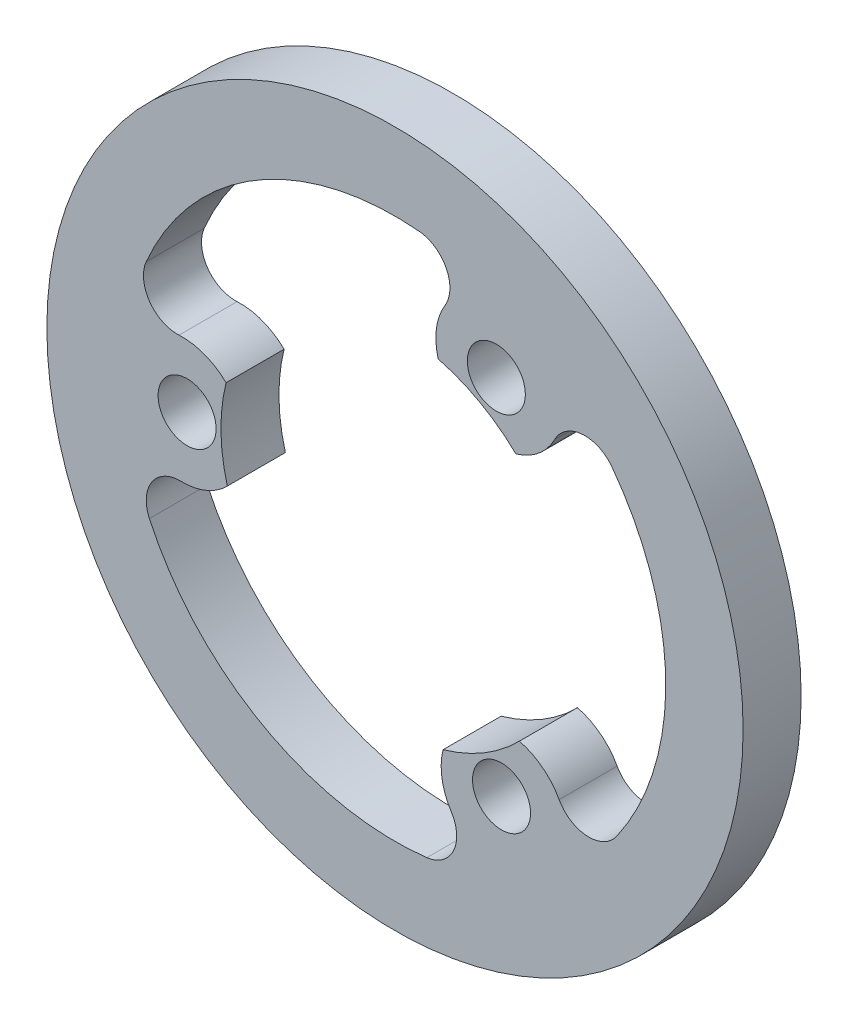
ISO-10303-21;
HEADER;
FILE_DESCRIPTION(('STEP AP214'),'2;1');
FILE_NAME('part.step','',(''),(''),'','','');
FILE_SCHEMA(('AUTOMOTIVE_DESIGN { 1 0 10303 214 1 1 1 1 }'));
ENDSEC;
DATA;
#1=APPLICATION_CONTEXT('core data for automotive mechanical design processes');
#2=APPLICATION_PROTOCOL_DEFINITION('international standard','automotive_design',2000,#1);
#3=PRODUCT_CONTEXT('',#1,'mechanical');
#4=PRODUCT('Part','Part','',(#3));
#5=PRODUCT_RELATED_PRODUCT_CATEGORY('part','',(#4));
#6=PRODUCT_DEFINITION_FORMATION('','',#4);
#7=PRODUCT_DEFINITION_CONTEXT('part definition',#1,'design');
#8=PRODUCT_DEFINITION('design','',#6,#7);
#9=PRODUCT_DEFINITION_SHAPE('','',#8);
#10=(LENGTH_UNIT() NAMED_UNIT(*) SI_UNIT(.MILLI.,.METRE.));
#11=(NAMED_UNIT(*) PLANE_ANGLE_UNIT() SI_UNIT($,.RADIAN.));
#12=(NAMED_UNIT(*) SI_UNIT($,.STERADIAN.) SOLID_ANGLE_UNIT());
#13=UNCERTAINTY_MEASURE_WITH_UNIT(LENGTH_MEASURE(1.E-05),#10,'distance_accuracy_value','');
#14=(GEOMETRIC_REPRESENTATION_CONTEXT(3) GLOBAL_UNCERTAINTY_ASSIGNED_CONTEXT((#13)) GLOBAL_UNIT_ASSIGNED_CONTEXT((#10,
#11,#12)) REPRESENTATION_CONTEXT('',''));
#15=CARTESIAN_POINT('',(0.,0.,0.));
#16=DIRECTION('',(0.,0.,1.));
#17=DIRECTION('',(1.,0.,0.));
#18=AXIS2_PLACEMENT_3D('',#15,#16,#17);
#19=CARTESIAN_POINT('',(0.,0.,3.));
#20=DIRECTION('',(0.,0.,1.));
#21=DIRECTION('',(1.,0.,0.));
#22=AXIS2_PLACEMENT_3D('',#19,#20,#21);
#23=PLANE('',#22);
#24=CARTESIAN_POINT('',(5.24045327565877,9.38616798622511,3.));
#25=DIRECTION('',(0.,0.,1.));
#26=DIRECTION('',(1.,0.,0.));
#27=AXIS2_PLACEMENT_3D('',#24,#25,#26);
#28=CIRCLE('',#27,1.49999999999964);
#29=CARTESIAN_POINT('',(6.74045327565841,9.38616798622511,3.));
#30=VERTEX_POINT('',#29);
#31=EDGE_CURVE('E558',#30,#30,#28,.T.);
#32=ORIENTED_EDGE('',*,*,#31,.F.);
#33=EDGE_LOOP('',(#32));
#34=FACE_BOUND('',#33,.T.);
#35=CARTESIAN_POINT('',(5.36232428206866,9.60445096264907,3.));
#36=DIRECTION('',(0.,0.,-1.));
#37=DIRECTION('',(1.,0.,0.));
#38=AXIS2_PLACEMENT_3D('',#35,#36,#37);
#39=CIRCLE('',#38,3.24999999999995);
#40=CARTESIAN_POINT('',(2.23557337278891,8.71792473555933,3.));
#41=VERTEX_POINT('',#40);
#42=CARTESIAN_POINT('',(2.58509341993289,11.2924938348535,3.));
#43=VERTEX_POINT('',#42);
#44=EDGE_CURVE('E165',#41,#43,#39,.T.);
#45=ORIENTED_EDGE('',*,*,#44,.F.);
#46=CARTESIAN_POINT('',(0.,0.,3.));
#47=DIRECTION('',(0.,0.,1.));
#48=DIRECTION('',(1.,0.,0.));
#49=AXIS2_PLACEMENT_3D('',#46,#47,#48);
#50=CIRCLE('',#49,9.);
#51=CARTESIAN_POINT('',(6.24831055075268,6.47754700958259,3.));
#52=VERTEX_POINT('',#51);
#53=EDGE_CURVE('E157',#52,#41,#50,.T.);
#54=ORIENTED_EDGE('',*,*,#53,.F.);
#55=CARTESIAN_POINT('',(5.36232428206866,9.60445096264907,3.));
#56=DIRECTION('',(0.,0.,-1.));
#57=DIRECTION('',(1.,0.,0.));
#58=AXIS2_PLACEMENT_3D('',#55,#56,#57);
#59=CIRCLE('',#58,3.24999999999991);
#60=CARTESIAN_POINT('',(8.25657900831403,8.12600935757779,3.));
#61=VERTEX_POINT('',#60);
#62=EDGE_CURVE('E211',#61,#52,#59,.T.);
#63=ORIENTED_EDGE('',*,*,#62,.F.);
#64=CARTESIAN_POINT('',(9.81502386090853,7.32992541638698,3.));
#65=DIRECTION('',(0.,0.,1.));
#66=DIRECTION('',(1.,0.,0.));
#67=AXIS2_PLACEMENT_3D('',#64,#65,#66);
#68=CIRCLE('',#67,1.75000000000001);
#69=CARTESIAN_POINT('',(11.2171701267533,8.37705761872707,3.));
#70=VERTEX_POINT('',#69);
#71=EDGE_CURVE('E209',#70,#61,#68,.T.);
#72=ORIENTED_EDGE('',*,*,#71,.F.);
#73=CARTESIAN_POINT('',(0.,0.,3.));
#74=DIRECTION('',(0.,0.,1.));
#75=DIRECTION('',(1.,0.,0.));
#76=AXIS2_PLACEMENT_3D('',#73,#74,#75);
#77=CIRCLE('',#76,14.);
#78=CARTESIAN_POINT('',(11.4536300472761,-8.05073653401565,3.));
#79=VERTEX_POINT('',#78);
#80=EDGE_CURVE('E207',#79,#70,#77,.T.);
#81=ORIENTED_EDGE('',*,*,#80,.F.);
#82=CARTESIAN_POINT('',(10.021926291367,-7.0443944672636,3.));
#83=DIRECTION('',(0.,0.,1.));
#84=DIRECTION('',(1.,0.,0.));
#85=AXIS2_PLACEMENT_3D('',#82,#83,#84);
#86=CIRCLE('',#85,1.74999999999971);
#87=CARTESIAN_POINT('',(8.48703982309588,-7.88500349024465,3.));
#88=VERTEX_POINT('',#87);
#89=EDGE_CURVE('E205',#88,#79,#86,.T.);
#90=ORIENTED_EDGE('',*,*,#89,.F.);
#91=CARTESIAN_POINT('',(5.63653638202168,-9.44613453292614,3.));
#92=DIRECTION('',(0.,0.,-1.));
#93=DIRECTION('',(1.,0.,0.));
#94=AXIS2_PLACEMENT_3D('',#91,#92,#93);
#95=CIRCLE('',#94,3.24999999999995);
#96=CARTESIAN_POINT('',(6.43215760288066,-6.29502570063892,3.));
#97=VERTEX_POINT('',#96);
#98=EDGE_CURVE('E203',#97,#88,#95,.T.);
#99=ORIENTED_EDGE('',*,*,#98,.F.);
#100=CARTESIAN_POINT('',(0.,0.,3.));
#101=DIRECTION('',(0.,0.,1.));
#102=DIRECTION('',(1.,0.,0.));
#103=AXIS2_PLACEMENT_3D('',#100,#101,#102);
#104=CIRCLE('',#103,9.);
#105=CARTESIAN_POINT('',(2.48556498913005,-8.64996917247749,3.));
#106=VERTEX_POINT('',#105);
#107=EDGE_CURVE('E201',#106,#97,#104,.T.);
#108=ORIENTED_EDGE('',*,*,#107,.F.);
#109=CARTESIAN_POINT('',(5.63653638202168,-9.44613453292614,3.));
#110=DIRECTION('',(0.,0.,-1.));
#111=DIRECTION('',(1.,0.,0.));
#112=AXIS2_PLACEMENT_3D('',#109,#110,#111);
#113=CIRCLE('',#112,3.24999999999996);
#114=CARTESIAN_POINT('',(2.90904103089539,-11.2134118483422,3.));
#115=VERTEX_POINT('',#114);
#116=EDGE_CURVE('E199',#115,#106,#113,.T.);
#117=ORIENTED_EDGE('',*,*,#116,.F.);
#118=CARTESIAN_POINT('',(1.4403896879821,-12.1650227104907,3.));
#119=DIRECTION('',(0.,0.,1.));
#120=DIRECTION('',(1.,0.,0.));
#121=AXIS2_PLACEMENT_3D('',#118,#119,#120);
#122=CIRCLE('',#121,1.75000000000001);
#123=CARTESIAN_POINT('',(1.64615964340708,-13.9028830977038,3.));
#124=VERTEX_POINT('',#123);
#125=EDGE_CURVE('E197',#124,#115,#122,.T.);
#126=ORIENTED_EDGE('',*,*,#125,.F.);
#127=CARTESIAN_POINT('',(0.,0.,3.));
#128=DIRECTION('',(0.,0.,1.));
#129=DIRECTION('',(1.,0.,0.));
#130=AXIS2_PLACEMENT_3D('',#127,#128,#129);
#131=CIRCLE('',#130,14.);
#132=CARTESIAN_POINT('',(-12.6989573812711,-5.89376631948197,3.));
#133=VERTEX_POINT('',#132);
#134=EDGE_CURVE('E195',#133,#124,#131,.T.);
#135=ORIENTED_EDGE('',*,*,#134,.F.);
#136=CARTESIAN_POINT('',(-11.1115877086123,-5.15704552954719,3.));
#137=DIRECTION('',(0.,0.,1.));
#138=DIRECTION('',(1.,0.,0.));
#139=AXIS2_PLACEMENT_3D('',#136,#137,#138);
#140=CIRCLE('',#139,1.7499999999997);
#141=CARTESIAN_POINT('',(-11.0721332430288,-3.4074903446089,3.));
#142=VERTEX_POINT('',#141);
#143=EDGE_CURVE('E193',#142,#133,#140,.T.);
#144=ORIENTED_EDGE('',*,*,#143,.F.);
#145=CARTESIAN_POINT('',(-10.9988606640903,-0.158316429722932,3.));
#146=DIRECTION('',(0.,0.,-1.));
#147=DIRECTION('',(1.,0.,0.));
#148=AXIS2_PLACEMENT_3D('',#145,#146,#147);
#149=CIRCLE('',#148,3.24999999999996);
#150=CARTESIAN_POINT('',(-8.66773097566957,-2.42289903492042,3.));
#151=VERTEX_POINT('',#150);
#152=EDGE_CURVE('E191',#151,#142,#149,.T.);
#153=ORIENTED_EDGE('',*,*,#152,.F.);
#154=CARTESIAN_POINT('',(0.,0.,3.));
#155=DIRECTION('',(0.,0.,1.));
#156=DIRECTION('',(1.,0.,0.));
#157=AXIS2_PLACEMENT_3D('',#154,#155,#156);
#158=CIRCLE('',#157,9.);
#159=CARTESIAN_POINT('',(-8.73387553988279,2.17242216289492,3.));
#160=VERTEX_POINT('',#159);
#161=EDGE_CURVE('E189',#160,#151,#158,.T.);
#162=ORIENTED_EDGE('',*,*,#161,.F.);
#163=CARTESIAN_POINT('',(-10.9988606640903,-0.158316429722932,3.));
#164=DIRECTION('',(0.,0.,-1.));
#165=DIRECTION('',(1.,0.,0.));
#166=AXIS2_PLACEMENT_3D('',#163,#164,#165);
#167=CIRCLE('',#166,3.24999999999995);
#168=CARTESIAN_POINT('',(-11.1656200392095,3.08740249076442,3.));
#169=VERTEX_POINT('',#168);
#170=EDGE_CURVE('E187',#169,#160,#167,.T.);
#171=ORIENTED_EDGE('',*,*,#170,.F.);
#172=CARTESIAN_POINT('',(-11.2554135488906,4.83509729410371,3.));
#173=DIRECTION('',(0.,0.,1.));
#174=DIRECTION('',(1.,0.,0.));
#175=AXIS2_PLACEMENT_3D('',#172,#173,#174);
#176=CIRCLE('',#175,1.75000000000001);
#177=CARTESIAN_POINT('',(-12.8633297701603,5.52582547897669,3.));
#178=VERTEX_POINT('',#177);
#179=EDGE_CURVE('E185',#178,#169,#176,.T.);
#180=ORIENTED_EDGE('',*,*,#179,.F.);
#181=CARTESIAN_POINT('',(0.,0.,3.));
#182=DIRECTION('',(0.,0.,1.));
#183=DIRECTION('',(1.,0.,0.));
#184=AXIS2_PLACEMENT_3D('',#181,#182,#183);
#185=CIRCLE('',#184,14.);
#186=CARTESIAN_POINT('',(1.24532733399512,13.9445028534977,3.));
#187=VERTEX_POINT('',#186);
#188=EDGE_CURVE('E180',#187,#178,#185,.T.);
#189=ORIENTED_EDGE('',*,*,#188,.F.);
#190=CARTESIAN_POINT('',(1.08966141724533,12.2014399968108,3.));
#191=DIRECTION('',(0.,0.,1.));
#192=DIRECTION('',(1.,0.,0.));
#193=AXIS2_PLACEMENT_3D('',#190,#191,#192);
#194=CIRCLE('',#193,1.7499999999997);
#195=EDGE_CURVE('E178',#43,#187,#194,.T.);
#196=ORIENTED_EDGE('',*,*,#195,.F.);
#197=EDGE_LOOP('',(#45,#54,#63,#72,#81,#90,#99,#108,#117,#126,#135,#144,#153,#162,#171,#180,
#189,#196));
#198=FACE_BOUND('',#197,.T.);
#199=CARTESIAN_POINT('',(0.,0.,3.));
#200=DIRECTION('',(0.,0.,1.));
#201=DIRECTION('',(1.,0.,0.));
#202=AXIS2_PLACEMENT_3D('',#199,#200,#201);
#203=CIRCLE('',#202,18.);
#204=CARTESIAN_POINT('',(18.,0.,3.));
#205=VERTEX_POINT('',#204);
#206=EDGE_CURVE('E11',#205,#205,#203,.T.);
#207=ORIENTED_EDGE('',*,*,#206,.T.);
#208=EDGE_LOOP('',(#207));
#209=FACE_BOUND('',#208,.T.);
#210=CARTESIAN_POINT('',(5.5084332824298,-9.23144965717842,3.));
#211=DIRECTION('',(0.,0.,1.));
#212=DIRECTION('',(1.,0.,0.));
#213=AXIS2_PLACEMENT_3D('',#210,#211,#212);
#214=CIRCLE('',#213,1.49999999999968);
#215=CARTESIAN_POINT('',(7.00843328242948,-9.23144965717842,3.));
#216=VERTEX_POINT('',#215);
#217=EDGE_CURVE('E214',#216,#216,#214,.T.);
#218=ORIENTED_EDGE('',*,*,#217,.F.);
#219=EDGE_LOOP('',(#218));
#220=FACE_BOUND('',#219,.T.);
#221=CARTESIAN_POINT('',(-10.7488865580886,-0.15471832904669,3.));
#222=DIRECTION('',(0.,0.,1.));
#223=DIRECTION('',(1.,0.,0.));
#224=AXIS2_PLACEMENT_3D('',#221,#222,#223);
#225=CIRCLE('',#224,1.49999999999971);
#226=CARTESIAN_POINT('',(-9.24888655808885,-0.15471832904669,3.));
#227=VERTEX_POINT('',#226);
#228=EDGE_CURVE('E549',#227,#227,#225,.T.);
#229=ORIENTED_EDGE('',*,*,#228,.F.);
#230=EDGE_LOOP('',(#229));
#231=FACE_BOUND('',#230,.T.);
#232=ADVANCED_FACE('F32',(#34,#198,#209,#220,#231),#23,.T.);
#233=CARTESIAN_POINT('',(0.,0.,0.));
#234=DIRECTION('',(0.,0.,1.));
#235=DIRECTION('',(1.,0.,0.));
#236=AXIS2_PLACEMENT_3D('',#233,#234,#235);
#237=PLANE('',#236);
#238=CARTESIAN_POINT('',(0.,0.,0.));
#239=DIRECTION('',(0.,0.,1.));
#240=DIRECTION('',(1.,0.,0.));
#241=AXIS2_PLACEMENT_3D('',#238,#239,#240);
#242=CIRCLE('',#241,18.);
#243=CARTESIAN_POINT('',(18.,0.,0.));
#244=VERTEX_POINT('',#243);
#245=EDGE_CURVE('E36',#244,#244,#242,.T.);
#246=ORIENTED_EDGE('',*,*,#245,.F.);
#247=EDGE_LOOP('',(#246));
#248=FACE_BOUND('',#247,.T.);
#249=CARTESIAN_POINT('',(0.,0.,0.));
#250=DIRECTION('',(0.,0.,1.));
#251=DIRECTION('',(1.,0.,0.));
#252=AXIS2_PLACEMENT_3D('',#249,#250,#251);
#253=CIRCLE('',#252,9.);
#254=CARTESIAN_POINT('',(6.24831055075268,6.47754700958259,0.));
#255=VERTEX_POINT('',#254);
#256=CARTESIAN_POINT('',(2.23557337278891,8.71792473555933,0.));
#257=VERTEX_POINT('',#256);
#258=EDGE_CURVE('E55',#255,#257,#253,.T.);
#259=ORIENTED_EDGE('',*,*,#258,.T.);
#260=CARTESIAN_POINT('',(5.36232428206866,9.60445096264907,0.));
#261=DIRECTION('',(0.,0.,-1.));
#262=DIRECTION('',(1.,0.,0.));
#263=AXIS2_PLACEMENT_3D('',#260,#261,#262);
#264=CIRCLE('',#263,3.24999999999995);
#265=CARTESIAN_POINT('',(2.58509341993289,11.2924938348535,0.));
#266=VERTEX_POINT('',#265);
#267=EDGE_CURVE('E172',#257,#266,#264,.T.);
#268=ORIENTED_EDGE('',*,*,#267,.T.);
#269=CARTESIAN_POINT('',(1.08966141724533,12.2014399968108,0.));
#270=DIRECTION('',(0.,0.,1.));
#271=DIRECTION('',(1.,0.,0.));
#272=AXIS2_PLACEMENT_3D('',#269,#270,#271);
#273=CIRCLE('',#272,1.7499999999997);
#274=CARTESIAN_POINT('',(1.24532733399512,13.9445028534977,0.));
#275=VERTEX_POINT('',#274);
#276=EDGE_CURVE('E216',#266,#275,#273,.T.);
#277=ORIENTED_EDGE('',*,*,#276,.T.);
#278=CARTESIAN_POINT('',(0.,0.,0.));
#279=DIRECTION('',(0.,0.,1.));
#280=DIRECTION('',(1.,0.,0.));
#281=AXIS2_PLACEMENT_3D('',#278,#279,#280);
#282=CIRCLE('',#281,14.);
#283=CARTESIAN_POINT('',(-12.8633297701603,5.52582547897669,0.));
#284=VERTEX_POINT('',#283);
#285=EDGE_CURVE('E219',#275,#284,#282,.T.);
#286=ORIENTED_EDGE('',*,*,#285,.T.);
#287=CARTESIAN_POINT('',(-11.2554135488906,4.83509729410371,0.));
#288=DIRECTION('',(0.,0.,1.));
#289=DIRECTION('',(1.,0.,0.));
#290=AXIS2_PLACEMENT_3D('',#287,#288,#289);
#291=CIRCLE('',#290,1.75000000000001);
#292=CARTESIAN_POINT('',(-11.1656200392095,3.08740249076442,0.));
#293=VERTEX_POINT('',#292);
#294=EDGE_CURVE('E222',#284,#293,#291,.T.);
#295=ORIENTED_EDGE('',*,*,#294,.T.);
#296=CARTESIAN_POINT('',(-10.9988606640903,-0.158316429722932,0.));
#297=DIRECTION('',(0.,0.,-1.));
#298=DIRECTION('',(1.,0.,0.));
#299=AXIS2_PLACEMENT_3D('',#296,#297,#298);
#300=CIRCLE('',#299,3.24999999999995);
#301=CARTESIAN_POINT('',(-8.73387553988279,2.17242216289492,0.));
#302=VERTEX_POINT('',#301);
#303=EDGE_CURVE('E225',#293,#302,#300,.T.);
#304=ORIENTED_EDGE('',*,*,#303,.T.);
#305=CARTESIAN_POINT('',(0.,0.,0.));
#306=DIRECTION('',(0.,0.,1.));
#307=DIRECTION('',(1.,0.,0.));
#308=AXIS2_PLACEMENT_3D('',#305,#306,#307);
#309=CIRCLE('',#308,9.);
#310=CARTESIAN_POINT('',(-8.66773097566957,-2.42289903492042,0.));
#311=VERTEX_POINT('',#310);
#312=EDGE_CURVE('E228',#302,#311,#309,.T.);
#313=ORIENTED_EDGE('',*,*,#312,.T.);
#314=CARTESIAN_POINT('',(-10.9988606640903,-0.158316429722932,0.));
#315=DIRECTION('',(0.,0.,-1.));
#316=DIRECTION('',(1.,0.,0.));
#317=AXIS2_PLACEMENT_3D('',#314,#315,#316);
#318=CIRCLE('',#317,3.24999999999996);
#319=CARTESIAN_POINT('',(-11.0721332430288,-3.4074903446089,0.));
#320=VERTEX_POINT('',#319);
#321=EDGE_CURVE('E231',#311,#320,#318,.T.);
#322=ORIENTED_EDGE('',*,*,#321,.T.);
#323=CARTESIAN_POINT('',(-11.1115877086123,-5.15704552954719,0.));
#324=DIRECTION('',(0.,0.,1.));
#325=DIRECTION('',(1.,0.,0.));
#326=AXIS2_PLACEMENT_3D('',#323,#324,#325);
#327=CIRCLE('',#326,1.7499999999997);
#328=CARTESIAN_POINT('',(-12.6989573812711,-5.89376631948197,0.));
#329=VERTEX_POINT('',#328);
#330=EDGE_CURVE('E234',#320,#329,#327,.T.);
#331=ORIENTED_EDGE('',*,*,#330,.T.);
#332=CARTESIAN_POINT('',(0.,0.,0.));
#333=DIRECTION('',(0.,0.,1.));
#334=DIRECTION('',(1.,0.,0.));
#335=AXIS2_PLACEMENT_3D('',#332,#333,#334);
#336=CIRCLE('',#335,14.);
#337=CARTESIAN_POINT('',(1.64615964340708,-13.9028830977038,0.));
#338=VERTEX_POINT('',#337);
#339=EDGE_CURVE('E237',#329,#338,#336,.T.);
#340=ORIENTED_EDGE('',*,*,#339,.T.);
#341=CARTESIAN_POINT('',(1.4403896879821,-12.1650227104907,0.));
#342=DIRECTION('',(0.,0.,1.));
#343=DIRECTION('',(1.,0.,0.));
#344=AXIS2_PLACEMENT_3D('',#341,#342,#343);
#345=CIRCLE('',#344,1.75000000000001);
#346=CARTESIAN_POINT('',(2.90904103089539,-11.2134118483422,0.));
#347=VERTEX_POINT('',#346);
#348=EDGE_CURVE('E240',#338,#347,#345,.T.);
#349=ORIENTED_EDGE('',*,*,#348,.T.);
#350=CARTESIAN_POINT('',(5.63653638202168,-9.44613453292614,0.));
#351=DIRECTION('',(0.,0.,-1.));
#352=DIRECTION('',(1.,0.,0.));
#353=AXIS2_PLACEMENT_3D('',#350,#351,#352);
#354=CIRCLE('',#353,3.24999999999996);
#355=CARTESIAN_POINT('',(2.48556498913005,-8.64996917247749,0.));
#356=VERTEX_POINT('',#355);
#357=EDGE_CURVE('E243',#347,#356,#354,.T.);
#358=ORIENTED_EDGE('',*,*,#357,.T.);
#359=CARTESIAN_POINT('',(0.,0.,0.));
#360=DIRECTION('',(0.,0.,1.));
#361=DIRECTION('',(1.,0.,0.));
#362=AXIS2_PLACEMENT_3D('',#359,#360,#361);
#363=CIRCLE('',#362,9.);
#364=CARTESIAN_POINT('',(6.43215760288066,-6.29502570063892,0.));
#365=VERTEX_POINT('',#364);
#366=EDGE_CURVE('E246',#356,#365,#363,.T.);
#367=ORIENTED_EDGE('',*,*,#366,.T.);
#368=CARTESIAN_POINT('',(5.63653638202168,-9.44613453292614,0.));
#369=DIRECTION('',(0.,0.,-1.));
#370=DIRECTION('',(1.,0.,0.));
#371=AXIS2_PLACEMENT_3D('',#368,#369,#370);
#372=CIRCLE('',#371,3.24999999999995);
#373=CARTESIAN_POINT('',(8.48703982309588,-7.88500349024465,0.));
#374=VERTEX_POINT('',#373);
#375=EDGE_CURVE('E249',#365,#374,#372,.T.);
#376=ORIENTED_EDGE('',*,*,#375,.T.);
#377=CARTESIAN_POINT('',(10.021926291367,-7.0443944672636,0.));
#378=DIRECTION('',(0.,0.,1.));
#379=DIRECTION('',(1.,0.,0.));
#380=AXIS2_PLACEMENT_3D('',#377,#378,#379);
#381=CIRCLE('',#380,1.74999999999971);
#382=CARTESIAN_POINT('',(11.4536300472761,-8.05073653401565,0.));
#383=VERTEX_POINT('',#382);
#384=EDGE_CURVE('E252',#374,#383,#381,.T.);
#385=ORIENTED_EDGE('',*,*,#384,.T.);
#386=CARTESIAN_POINT('',(0.,0.,0.));
#387=DIRECTION('',(0.,0.,1.));
#388=DIRECTION('',(1.,0.,0.));
#389=AXIS2_PLACEMENT_3D('',#386,#387,#388);
#390=CIRCLE('',#389,14.);
#391=CARTESIAN_POINT('',(11.2171701267533,8.37705761872707,0.));
#392=VERTEX_POINT('',#391);
#393=EDGE_CURVE('E255',#383,#392,#390,.T.);
#394=ORIENTED_EDGE('',*,*,#393,.T.);
#395=CARTESIAN_POINT('',(9.81502386090853,7.32992541638698,0.));
#396=DIRECTION('',(0.,0.,1.));
#397=DIRECTION('',(1.,0.,0.));
#398=AXIS2_PLACEMENT_3D('',#395,#396,#397);
#399=CIRCLE('',#398,1.75000000000001);
#400=CARTESIAN_POINT('',(8.25657900831407,8.12600935757778,0.));
#401=VERTEX_POINT('',#400);
#402=EDGE_CURVE('E258',#392,#401,#399,.T.);
#403=ORIENTED_EDGE('',*,*,#402,.T.);
#404=CARTESIAN_POINT('',(5.36232428206866,9.60445096264907,0.));
#405=DIRECTION('',(0.,0.,-1.));
#406=DIRECTION('',(1.,0.,0.));
#407=AXIS2_PLACEMENT_3D('',#404,#405,#406);
#408=CIRCLE('',#407,3.24999999999991);
#409=EDGE_CURVE('E166',#401,#255,#408,.T.);
#410=ORIENTED_EDGE('',*,*,#409,.T.);
#411=EDGE_LOOP('',(#259,#268,#277,#286,#295,#304,#313,#322,#331,#340,#349,#358,#367,#376,#385,
#394,#403,#410));
#412=FACE_BOUND('',#411,.T.);
#413=CARTESIAN_POINT('',(5.5084332824298,-9.23144965717842,0.));
#414=DIRECTION('',(0.,0.,1.));
#415=DIRECTION('',(1.,0.,0.));
#416=AXIS2_PLACEMENT_3D('',#413,#414,#415);
#417=CIRCLE('',#416,1.49999999999968);
#418=CARTESIAN_POINT('',(7.00843328242948,-9.23144965717842,0.));
#419=VERTEX_POINT('',#418);
#420=EDGE_CURVE('E561',#419,#419,#417,.T.);
#421=ORIENTED_EDGE('',*,*,#420,.T.);
#422=EDGE_LOOP('',(#421));
#423=FACE_BOUND('',#422,.T.);
#424=CARTESIAN_POINT('',(5.24045327565877,9.38616798622511,0.));
#425=DIRECTION('',(0.,0.,1.));
#426=DIRECTION('',(1.,0.,0.));
#427=AXIS2_PLACEMENT_3D('',#424,#425,#426);
#428=CIRCLE('',#427,1.49999999999964);
#429=CARTESIAN_POINT('',(6.74045327565841,9.38616798622511,0.));
#430=VERTEX_POINT('',#429);
#431=EDGE_CURVE('E555',#430,#430,#428,.T.);
#432=ORIENTED_EDGE('',*,*,#431,.T.);
#433=EDGE_LOOP('',(#432));
#434=FACE_BOUND('',#433,.T.);
#435=CARTESIAN_POINT('',(-10.7488865580886,-0.15471832904669,0.));
#436=DIRECTION('',(0.,0.,1.));
#437=DIRECTION('',(1.,0.,0.));
#438=AXIS2_PLACEMENT_3D('',#435,#436,#437);
#439=CIRCLE('',#438,1.49999999999971);
#440=CARTESIAN_POINT('',(-9.24888655808885,-0.15471832904669,0.));
#441=VERTEX_POINT('',#440);
#442=EDGE_CURVE('E552',#441,#441,#439,.T.);
#443=ORIENTED_EDGE('',*,*,#442,.T.);
#444=EDGE_LOOP('',(#443));
#445=FACE_BOUND('',#444,.T.);
#446=ADVANCED_FACE('F299',(#248,#412,#423,#434,#445),#237,.F.);
#447=CARTESIAN_POINT('',(0.,0.,3.));
#448=DIRECTION('',(0.,0.,-1.));
#449=DIRECTION('',(-1.,0.,0.));
#450=AXIS2_PLACEMENT_3D('',#447,#448,#449);
#451=CYLINDRICAL_SURFACE('',#450,18.);
#452=ORIENTED_EDGE('',*,*,#206,.F.);
#453=EDGE_LOOP('',(#452));
#454=FACE_BOUND('',#453,.T.);
#455=ORIENTED_EDGE('',*,*,#245,.T.);
#456=EDGE_LOOP('',(#455));
#457=FACE_BOUND('',#456,.T.);
#458=ADVANCED_FACE('F34',(#454,#457),#451,.T.);
#459=CARTESIAN_POINT('',(0.,0.,3.));
#460=DIRECTION('',(0.,0.,-1.));
#461=DIRECTION('',(-1.,0.,0.));
#462=AXIS2_PLACEMENT_3D('',#459,#460,#461);
#463=CYLINDRICAL_SURFACE('',#462,9.);
#464=ORIENTED_EDGE('',*,*,#258,.F.);
#465=DIRECTION('',(0.,0.,-1.));
#466=VECTOR('',#465,1.);
#467=CARTESIAN_POINT('',(6.24831055075268,6.47754700958259,3.));
#468=LINE('',#467,#466);
#469=EDGE_CURVE('E161',#52,#255,#468,.T.);
#470=ORIENTED_EDGE('',*,*,#469,.F.);
#471=ORIENTED_EDGE('',*,*,#53,.T.);
#472=DIRECTION('',(0.,0.,-1.));
#473=VECTOR('',#472,1.);
#474=CARTESIAN_POINT('',(2.23557337278891,8.71792473555933,3.));
#475=LINE('',#474,#473);
#476=EDGE_CURVE('E160',#41,#257,#475,.T.);
#477=ORIENTED_EDGE('',*,*,#476,.T.);
#478=EDGE_LOOP('',(#464,#470,#471,#477));
#479=FACE_BOUND('',#478,.T.);
#480=ADVANCED_FACE('F159',(#479),#463,.F.);
#481=CARTESIAN_POINT('',(5.36232428206866,9.60445096264907,3.));
#482=DIRECTION('',(0.,0.,-1.));
#483=DIRECTION('',(-1.,0.,0.));
#484=AXIS2_PLACEMENT_3D('',#481,#482,#483);
#485=CYLINDRICAL_SURFACE('',#484,3.24999999999995);
#486=ORIENTED_EDGE('',*,*,#267,.F.);
#487=ORIENTED_EDGE('',*,*,#476,.F.);
#488=ORIENTED_EDGE('',*,*,#44,.T.);
#489=DIRECTION('',(0.,0.,-1.));
#490=VECTOR('',#489,1.);
#491=CARTESIAN_POINT('',(2.58509341993289,11.2924938348535,3.));
#492=LINE('',#491,#490);
#493=EDGE_CURVE('E173',#43,#266,#492,.T.);
#494=ORIENTED_EDGE('',*,*,#493,.T.);
#495=EDGE_LOOP('',(#486,#487,#488,#494));
#496=FACE_BOUND('',#495,.T.);
#497=ADVANCED_FACE('F169',(#496),#485,.T.);
#498=CARTESIAN_POINT('',(1.08966141724533,12.2014399968108,3.));
#499=DIRECTION('',(0.,0.,-1.));
#500=DIRECTION('',(-1.,0.,0.));
#501=AXIS2_PLACEMENT_3D('',#498,#499,#500);
#502=CYLINDRICAL_SURFACE('',#501,1.7499999999997);
#503=ORIENTED_EDGE('',*,*,#276,.F.);
#504=ORIENTED_EDGE('',*,*,#493,.F.);
#505=ORIENTED_EDGE('',*,*,#195,.T.);
#506=DIRECTION('',(0.,0.,-1.));
#507=VECTOR('',#506,1.);
#508=CARTESIAN_POINT('',(1.24532733399512,13.9445028534977,3.));
#509=LINE('',#508,#507);
#510=EDGE_CURVE('E291',#187,#275,#509,.T.);
#511=ORIENTED_EDGE('',*,*,#510,.T.);
#512=EDGE_LOOP('',(#503,#504,#505,#511));
#513=FACE_BOUND('',#512,.T.);
#514=ADVANCED_FACE('F295',(#513),#502,.F.);
#515=CARTESIAN_POINT('',(0.,0.,3.));
#516=DIRECTION('',(0.,0.,-1.));
#517=DIRECTION('',(-1.,0.,0.));
#518=AXIS2_PLACEMENT_3D('',#515,#516,#517);
#519=CYLINDRICAL_SURFACE('',#518,14.);
#520=ORIENTED_EDGE('',*,*,#285,.F.);
#521=ORIENTED_EDGE('',*,*,#510,.F.);
#522=ORIENTED_EDGE('',*,*,#188,.T.);
#523=DIRECTION('',(0.,0.,-1.));
#524=VECTOR('',#523,1.);
#525=CARTESIAN_POINT('',(-12.8633297701603,5.52582547897669,3.));
#526=LINE('',#525,#524);
#527=EDGE_CURVE('E289',#178,#284,#526,.T.);
#528=ORIENTED_EDGE('',*,*,#527,.T.);
#529=EDGE_LOOP('',(#520,#521,#522,#528));
#530=FACE_BOUND('',#529,.T.);
#531=ADVANCED_FACE('F368',(#530),#519,.F.);
#532=CARTESIAN_POINT('',(-11.2554135488906,4.83509729410371,3.));
#533=DIRECTION('',(0.,0.,-1.));
#534=DIRECTION('',(-1.,0.,0.));
#535=AXIS2_PLACEMENT_3D('',#532,#533,#534);
#536=CYLINDRICAL_SURFACE('',#535,1.75000000000001);
#537=ORIENTED_EDGE('',*,*,#294,.F.);
#538=ORIENTED_EDGE('',*,*,#527,.F.);
#539=ORIENTED_EDGE('',*,*,#179,.T.);
#540=DIRECTION('',(0.,0.,-1.));
#541=VECTOR('',#540,1.);
#542=CARTESIAN_POINT('',(-11.1656200392095,3.08740249076442,3.));
#543=LINE('',#542,#541);
#544=EDGE_CURVE('E287',#169,#293,#543,.T.);
#545=ORIENTED_EDGE('',*,*,#544,.T.);
#546=EDGE_LOOP('',(#537,#538,#539,#545));
#547=FACE_BOUND('',#546,.T.);
#548=ADVANCED_FACE('F366',(#547),#536,.F.);
#549=CARTESIAN_POINT('',(-10.9988606640903,-0.158316429722932,3.));
#550=DIRECTION('',(0.,0.,-1.));
#551=DIRECTION('',(-1.,0.,0.));
#552=AXIS2_PLACEMENT_3D('',#549,#550,#551);
#553=CYLINDRICAL_SURFACE('',#552,3.24999999999995);
#554=ORIENTED_EDGE('',*,*,#303,.F.);
#555=ORIENTED_EDGE('',*,*,#544,.F.);
#556=ORIENTED_EDGE('',*,*,#170,.T.);
#557=DIRECTION('',(0.,0.,-1.));
#558=VECTOR('',#557,1.);
#559=CARTESIAN_POINT('',(-8.73387553988279,2.17242216289492,3.));
#560=LINE('',#559,#558);
#561=EDGE_CURVE('E285',#160,#302,#560,.T.);
#562=ORIENTED_EDGE('',*,*,#561,.T.);
#563=EDGE_LOOP('',(#554,#555,#556,#562));
#564=FACE_BOUND('',#563,.T.);
#565=ADVANCED_FACE('F360',(#564),#553,.T.);
#566=CARTESIAN_POINT('',(0.,0.,3.));
#567=DIRECTION('',(0.,0.,-1.));
#568=DIRECTION('',(-1.,0.,0.));
#569=AXIS2_PLACEMENT_3D('',#566,#567,#568);
#570=CYLINDRICAL_SURFACE('',#569,9.);
#571=ORIENTED_EDGE('',*,*,#312,.F.);
#572=ORIENTED_EDGE('',*,*,#561,.F.);
#573=ORIENTED_EDGE('',*,*,#161,.T.);
#574=DIRECTION('',(0.,0.,-1.));
#575=VECTOR('',#574,1.);
#576=CARTESIAN_POINT('',(-8.66773097566957,-2.42289903492042,3.));
#577=LINE('',#576,#575);
#578=EDGE_CURVE('E283',#151,#311,#577,.T.);
#579=ORIENTED_EDGE('',*,*,#578,.T.);
#580=EDGE_LOOP('',(#571,#572,#573,#579));
#581=FACE_BOUND('',#580,.T.);
#582=ADVANCED_FACE('F356',(#581),#570,.F.);
#583=CARTESIAN_POINT('',(-10.9988606640903,-0.158316429722932,3.));
#584=DIRECTION('',(0.,0.,-1.));
#585=DIRECTION('',(-1.,0.,0.));
#586=AXIS2_PLACEMENT_3D('',#583,#584,#585);
#587=CYLINDRICAL_SURFACE('',#586,3.24999999999996);
#588=ORIENTED_EDGE('',*,*,#321,.F.);
#589=ORIENTED_EDGE('',*,*,#578,.F.);
#590=ORIENTED_EDGE('',*,*,#152,.T.);
#591=DIRECTION('',(0.,0.,-1.));
#592=VECTOR('',#591,1.);
#593=CARTESIAN_POINT('',(-11.0721332430288,-3.4074903446089,3.));
#594=LINE('',#593,#592);
#595=EDGE_CURVE('E281',#142,#320,#594,.T.);
#596=ORIENTED_EDGE('',*,*,#595,.T.);
#597=EDGE_LOOP('',(#588,#589,#590,#596));
#598=FACE_BOUND('',#597,.T.);
#599=ADVANCED_FACE('F353',(#598),#587,.T.);
#600=CARTESIAN_POINT('',(-11.1115877086123,-5.15704552954719,3.));
#601=DIRECTION('',(0.,0.,-1.));
#602=DIRECTION('',(-1.,0.,0.));
#603=AXIS2_PLACEMENT_3D('',#600,#601,#602);
#604=CYLINDRICAL_SURFACE('',#603,1.7499999999997);
#605=ORIENTED_EDGE('',*,*,#330,.F.);
#606=ORIENTED_EDGE('',*,*,#595,.F.);
#607=ORIENTED_EDGE('',*,*,#143,.T.);
#608=DIRECTION('',(0.,0.,-1.));
#609=VECTOR('',#608,1.);
#610=CARTESIAN_POINT('',(-12.6989573812711,-5.89376631948197,3.));
#611=LINE('',#610,#609);
#612=EDGE_CURVE('E279',#133,#329,#611,.T.);
#613=ORIENTED_EDGE('',*,*,#612,.T.);
#614=EDGE_LOOP('',(#605,#606,#607,#613));
#615=FACE_BOUND('',#614,.T.);
#616=ADVANCED_FACE('F345',(#615),#604,.F.);
#617=CARTESIAN_POINT('',(0.,0.,3.));
#618=DIRECTION('',(0.,0.,-1.));
#619=DIRECTION('',(-1.,0.,0.));
#620=AXIS2_PLACEMENT_3D('',#617,#618,#619);
#621=CYLINDRICAL_SURFACE('',#620,14.);
#622=ORIENTED_EDGE('',*,*,#339,.F.);
#623=ORIENTED_EDGE('',*,*,#612,.F.);
#624=ORIENTED_EDGE('',*,*,#134,.T.);
#625=DIRECTION('',(0.,0.,-1.));
#626=VECTOR('',#625,1.);
#627=CARTESIAN_POINT('',(1.64615964340708,-13.9028830977038,3.));
#628=LINE('',#627,#626);
#629=EDGE_CURVE('E277',#124,#338,#628,.T.);
#630=ORIENTED_EDGE('',*,*,#629,.T.);
#631=EDGE_LOOP('',(#622,#623,#624,#630));
#632=FACE_BOUND('',#631,.T.);
#633=ADVANCED_FACE('F341',(#632),#621,.F.);
#634=CARTESIAN_POINT('',(1.4403896879821,-12.1650227104907,3.));
#635=DIRECTION('',(0.,0.,-1.));
#636=DIRECTION('',(-1.,0.,0.));
#637=AXIS2_PLACEMENT_3D('',#634,#635,#636);
#638=CYLINDRICAL_SURFACE('',#637,1.75000000000001);
#639=ORIENTED_EDGE('',*,*,#348,.F.);
#640=ORIENTED_EDGE('',*,*,#629,.F.);
#641=ORIENTED_EDGE('',*,*,#125,.T.);
#642=DIRECTION('',(0.,0.,-1.));
#643=VECTOR('',#642,1.);
#644=CARTESIAN_POINT('',(2.90904103089539,-11.2134118483422,3.));
#645=LINE('',#644,#643);
#646=EDGE_CURVE('E275',#115,#347,#645,.T.);
#647=ORIENTED_EDGE('',*,*,#646,.T.);
#648=EDGE_LOOP('',(#639,#640,#641,#647));
#649=FACE_BOUND('',#648,.T.);
#650=ADVANCED_FACE('F338',(#649),#638,.F.);
#651=CARTESIAN_POINT('',(5.63653638202168,-9.44613453292614,3.));
#652=DIRECTION('',(0.,0.,-1.));
#653=DIRECTION('',(-1.,0.,0.));
#654=AXIS2_PLACEMENT_3D('',#651,#652,#653);
#655=CYLINDRICAL_SURFACE('',#654,3.24999999999996);
#656=ORIENTED_EDGE('',*,*,#357,.F.);
#657=ORIENTED_EDGE('',*,*,#646,.F.);
#658=ORIENTED_EDGE('',*,*,#116,.T.);
#659=DIRECTION('',(0.,0.,-1.));
#660=VECTOR('',#659,1.);
#661=CARTESIAN_POINT('',(2.48556498913005,-8.64996917247749,3.));
#662=LINE('',#661,#660);
#663=EDGE_CURVE('E273',#106,#356,#662,.T.);
#664=ORIENTED_EDGE('',*,*,#663,.T.);
#665=EDGE_LOOP('',(#656,#657,#658,#664));
#666=FACE_BOUND('',#665,.T.);
#667=ADVANCED_FACE('F330',(#666),#655,.T.);
#668=CARTESIAN_POINT('',(0.,0.,3.));
#669=DIRECTION('',(0.,0.,-1.));
#670=DIRECTION('',(-1.,0.,0.));
#671=AXIS2_PLACEMENT_3D('',#668,#669,#670);
#672=CYLINDRICAL_SURFACE('',#671,9.);
#673=ORIENTED_EDGE('',*,*,#366,.F.);
#674=ORIENTED_EDGE('',*,*,#663,.F.);
#675=ORIENTED_EDGE('',*,*,#107,.T.);
#676=DIRECTION('',(0.,0.,-1.));
#677=VECTOR('',#676,1.);
#678=CARTESIAN_POINT('',(6.43215760288066,-6.29502570063892,3.));
#679=LINE('',#678,#677);
#680=EDGE_CURVE('E271',#97,#365,#679,.T.);
#681=ORIENTED_EDGE('',*,*,#680,.T.);
#682=EDGE_LOOP('',(#673,#674,#675,#681));
#683=FACE_BOUND('',#682,.T.);
#684=ADVANCED_FACE('F326',(#683),#672,.F.);
#685=CARTESIAN_POINT('',(5.63653638202168,-9.44613453292614,3.));
#686=DIRECTION('',(0.,0.,-1.));
#687=DIRECTION('',(-1.,0.,0.));
#688=AXIS2_PLACEMENT_3D('',#685,#686,#687);
#689=CYLINDRICAL_SURFACE('',#688,3.24999999999995);
#690=ORIENTED_EDGE('',*,*,#375,.F.);
#691=ORIENTED_EDGE('',*,*,#680,.F.);
#692=ORIENTED_EDGE('',*,*,#98,.T.);
#693=DIRECTION('',(0.,0.,-1.));
#694=VECTOR('',#693,1.);
#695=CARTESIAN_POINT('',(8.48703982309588,-7.88500349024465,3.));
#696=LINE('',#695,#694);
#697=EDGE_CURVE('E269',#88,#374,#696,.T.);
#698=ORIENTED_EDGE('',*,*,#697,.T.);
#699=EDGE_LOOP('',(#690,#691,#692,#698));
#700=FACE_BOUND('',#699,.T.);
#701=ADVANCED_FACE('F323',(#700),#689,.T.);
#702=CARTESIAN_POINT('',(10.021926291367,-7.0443944672636,3.));
#703=DIRECTION('',(0.,0.,-1.));
#704=DIRECTION('',(-1.,0.,0.));
#705=AXIS2_PLACEMENT_3D('',#702,#703,#704);
#706=CYLINDRICAL_SURFACE('',#705,1.74999999999971);
#707=ORIENTED_EDGE('',*,*,#384,.F.);
#708=ORIENTED_EDGE('',*,*,#697,.F.);
#709=ORIENTED_EDGE('',*,*,#89,.T.);
#710=DIRECTION('',(0.,0.,-1.));
#711=VECTOR('',#710,1.);
#712=CARTESIAN_POINT('',(11.4536300472761,-8.05073653401565,3.));
#713=LINE('',#712,#711);
#714=EDGE_CURVE('E267',#79,#383,#713,.T.);
#715=ORIENTED_EDGE('',*,*,#714,.T.);
#716=EDGE_LOOP('',(#707,#708,#709,#715));
#717=FACE_BOUND('',#716,.T.);
#718=ADVANCED_FACE('F315',(#717),#706,.F.);
#719=CARTESIAN_POINT('',(0.,0.,3.));
#720=DIRECTION('',(0.,0.,-1.));
#721=DIRECTION('',(-1.,0.,0.));
#722=AXIS2_PLACEMENT_3D('',#719,#720,#721);
#723=CYLINDRICAL_SURFACE('',#722,14.);
#724=ORIENTED_EDGE('',*,*,#393,.F.);
#725=ORIENTED_EDGE('',*,*,#714,.F.);
#726=ORIENTED_EDGE('',*,*,#80,.T.);
#727=DIRECTION('',(0.,0.,-1.));
#728=VECTOR('',#727,1.);
#729=CARTESIAN_POINT('',(11.2171701267533,8.37705761872707,3.));
#730=LINE('',#729,#728);
#731=EDGE_CURVE('E265',#70,#392,#730,.T.);
#732=ORIENTED_EDGE('',*,*,#731,.T.);
#733=EDGE_LOOP('',(#724,#725,#726,#732));
#734=FACE_BOUND('',#733,.T.);
#735=ADVANCED_FACE('F311',(#734),#723,.F.);
#736=CARTESIAN_POINT('',(9.81502386090853,7.32992541638698,3.));
#737=DIRECTION('',(0.,0.,-1.));
#738=DIRECTION('',(-1.,0.,0.));
#739=AXIS2_PLACEMENT_3D('',#736,#737,#738);
#740=CYLINDRICAL_SURFACE('',#739,1.75000000000001);
#741=ORIENTED_EDGE('',*,*,#402,.F.);
#742=ORIENTED_EDGE('',*,*,#731,.F.);
#743=ORIENTED_EDGE('',*,*,#71,.T.);
#744=DIRECTION('',(0.,0.,-1.));
#745=VECTOR('',#744,1.);
#746=CARTESIAN_POINT('',(8.25657900831407,8.12600935757778,3.));
#747=LINE('',#746,#745);
#748=EDGE_CURVE('E47',#61,#401,#747,.T.);
#749=ORIENTED_EDGE('',*,*,#748,.T.);
#750=EDGE_LOOP('',(#741,#742,#743,#749));
#751=FACE_BOUND('',#750,.T.);
#752=ADVANCED_FACE('F308',(#751),#740,.F.);
#753=CARTESIAN_POINT('',(5.36232428206866,9.60445096264907,3.));
#754=DIRECTION('',(0.,0.,-1.));
#755=DIRECTION('',(-1.,0.,0.));
#756=AXIS2_PLACEMENT_3D('',#753,#754,#755);
#757=CYLINDRICAL_SURFACE('',#756,3.24999999999991);
#758=ORIENTED_EDGE('',*,*,#409,.F.);
#759=ORIENTED_EDGE('',*,*,#748,.F.);
#760=ORIENTED_EDGE('',*,*,#62,.T.);
#761=ORIENTED_EDGE('',*,*,#469,.T.);
#762=EDGE_LOOP('',(#758,#759,#760,#761));
#763=FACE_BOUND('',#762,.T.);
#764=ADVANCED_FACE('F302',(#763),#757,.T.);
#765=CARTESIAN_POINT('',(5.5084332824298,-9.23144965717842,3.));
#766=DIRECTION('',(0.,0.,-1.));
#767=DIRECTION('',(-1.,0.,0.));
#768=AXIS2_PLACEMENT_3D('',#765,#766,#767);
#769=CYLINDRICAL_SURFACE('',#768,1.49999999999968);
#770=ORIENTED_EDGE('',*,*,#217,.T.);
#771=EDGE_LOOP('',(#770));
#772=FACE_BOUND('',#771,.T.);
#773=ORIENTED_EDGE('',*,*,#420,.F.);
#774=EDGE_LOOP('',(#773));
#775=FACE_BOUND('',#774,.T.);
#776=ADVANCED_FACE('F513',(#772,#775),#769,.F.);
#777=CARTESIAN_POINT('',(5.24045327565877,9.38616798622511,3.));
#778=DIRECTION('',(0.,0.,-1.));
#779=DIRECTION('',(-1.,0.,0.));
#780=AXIS2_PLACEMENT_3D('',#777,#778,#779);
#781=CYLINDRICAL_SURFACE('',#780,1.49999999999964);
#782=ORIENTED_EDGE('',*,*,#31,.T.);
#783=EDGE_LOOP('',(#782));
#784=FACE_BOUND('',#783,.T.);
#785=ORIENTED_EDGE('',*,*,#431,.F.);
#786=EDGE_LOOP('',(#785));
#787=FACE_BOUND('',#786,.T.);
#788=ADVANCED_FACE('F522',(#784,#787),#781,.F.);
#789=CARTESIAN_POINT('',(-10.7488865580886,-0.15471832904669,3.));
#790=DIRECTION('',(0.,0.,-1.));
#791=DIRECTION('',(-1.,0.,0.));
#792=AXIS2_PLACEMENT_3D('',#789,#790,#791);
#793=CYLINDRICAL_SURFACE('',#792,1.49999999999971);
#794=ORIENTED_EDGE('',*,*,#228,.T.);
#795=EDGE_LOOP('',(#794));
#796=FACE_BOUND('',#795,.T.);
#797=ORIENTED_EDGE('',*,*,#442,.F.);
#798=EDGE_LOOP('',(#797));
#799=FACE_BOUND('',#798,.T.);
#800=ADVANCED_FACE('F532',(#796,#799),#793,.F.);
#801=CLOSED_SHELL('',(#232,#446,#458,#480,#497,#514,#531,#548,#565,#582,#599,#616,#633,#650,
#667,#684,#701,#718,#735,#752,#764,#776,#788,#800));
#802=MANIFOLD_SOLID_BREP('B2',#801);
#803=ADVANCED_BREP_SHAPE_REPRESENTATION('',(#18,#802),#14);
#804=SHAPE_DEFINITION_REPRESENTATION(#9,#803);
ENDSEC;
END-ISO-10303-21;
